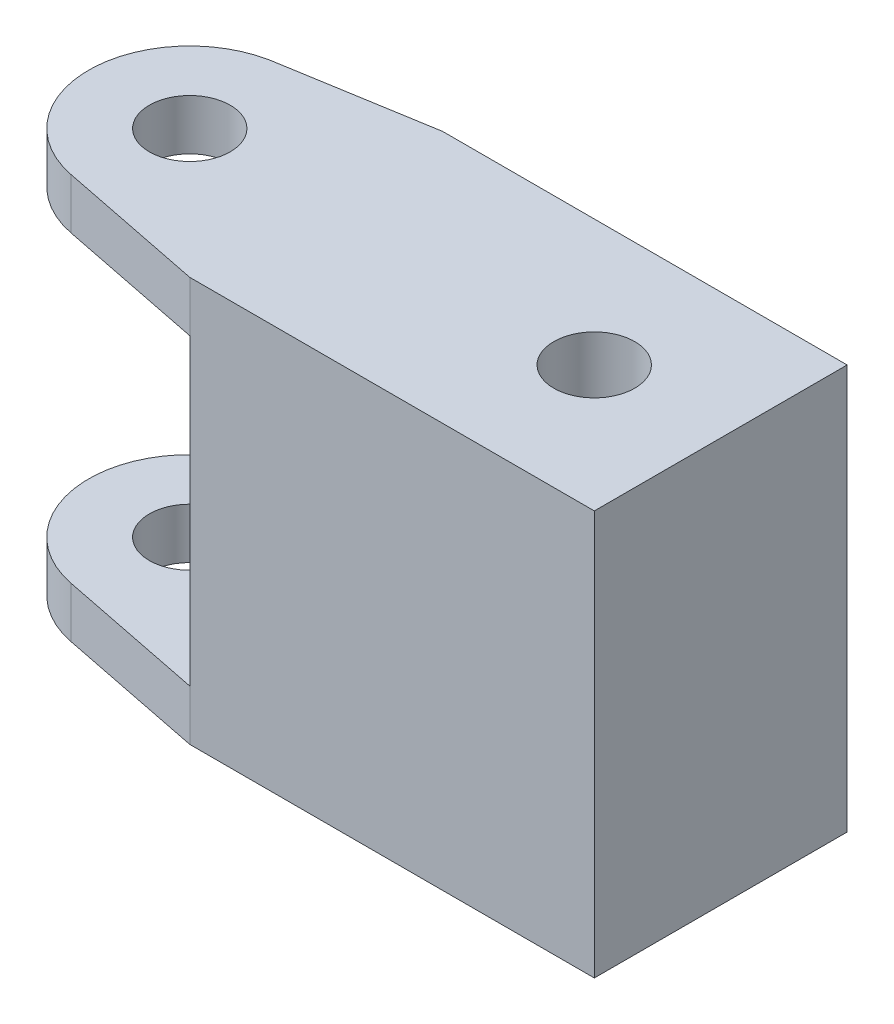
ISO-10303-21;
HEADER;
FILE_DESCRIPTION(('STEP AP214'),'2;1');
FILE_NAME('part.step','',(''),(''),'','','');
FILE_SCHEMA(('AUTOMOTIVE_DESIGN { 1 0 10303 214 1 1 1 1 }'));
ENDSEC;
DATA;
#1=APPLICATION_CONTEXT('core data for automotive mechanical design processes');
#2=APPLICATION_PROTOCOL_DEFINITION('international standard','automotive_design',2000,#1);
#3=PRODUCT_CONTEXT('',#1,'mechanical');
#4=PRODUCT('Part','Part','',(#3));
#5=PRODUCT_RELATED_PRODUCT_CATEGORY('part','',(#4));
#6=PRODUCT_DEFINITION_FORMATION('','',#4);
#7=PRODUCT_DEFINITION_CONTEXT('part definition',#1,'design');
#8=PRODUCT_DEFINITION('design','',#6,#7);
#9=PRODUCT_DEFINITION_SHAPE('','',#8);
#10=(LENGTH_UNIT() NAMED_UNIT(*) SI_UNIT(.MILLI.,.METRE.));
#11=(NAMED_UNIT(*) PLANE_ANGLE_UNIT() SI_UNIT($,.RADIAN.));
#12=(NAMED_UNIT(*) SI_UNIT($,.STERADIAN.) SOLID_ANGLE_UNIT());
#13=UNCERTAINTY_MEASURE_WITH_UNIT(LENGTH_MEASURE(1.E-05),#10,'distance_accuracy_value','');
#14=(GEOMETRIC_REPRESENTATION_CONTEXT(3) GLOBAL_UNCERTAINTY_ASSIGNED_CONTEXT((#13)) GLOBAL_UNIT_ASSIGNED_CONTEXT((#10,
#11,#12)) REPRESENTATION_CONTEXT('',''));
#15=CARTESIAN_POINT('',(0.,0.,0.));
#16=DIRECTION('',(0.,0.,1.));
#17=DIRECTION('',(1.,0.,0.));
#18=AXIS2_PLACEMENT_3D('',#15,#16,#17);
#19=CARTESIAN_POINT('',(20.,20.,25.));
#20=DIRECTION('',(-1.,0.,0.));
#21=DIRECTION('',(0.,-1.,0.));
#22=AXIS2_PLACEMENT_3D('',#19,#20,#21);
#23=PLANE('',#22);
#24=DIRECTION('',(0.,1.,0.));
#25=VECTOR('',#24,1.);
#26=CARTESIAN_POINT('',(20.,20.,0.));
#27=LINE('',#26,#25);
#28=CARTESIAN_POINT('',(20.,-20.,0.));
#29=VERTEX_POINT('',#28);
#30=CARTESIAN_POINT('',(20.,20.,0.));
#31=VERTEX_POINT('',#30);
#32=EDGE_CURVE('E202',#29,#31,#27,.T.);
#33=ORIENTED_EDGE('',*,*,#32,.T.);
#34=DIRECTION('',(0.,0.,-1.));
#35=VECTOR('',#34,1.);
#36=CARTESIAN_POINT('',(20.,20.,25.));
#37=LINE('',#36,#35);
#38=CARTESIAN_POINT('',(20.,20.,25.));
#39=VERTEX_POINT('',#38);
#40=EDGE_CURVE('E11',#39,#31,#37,.T.);
#41=ORIENTED_EDGE('',*,*,#40,.F.);
#42=DIRECTION('',(0.,1.,0.));
#43=VECTOR('',#42,1.);
#44=CARTESIAN_POINT('',(20.,20.,25.));
#45=LINE('',#44,#43);
#46=CARTESIAN_POINT('',(20.,-20.,25.));
#47=VERTEX_POINT('',#46);
#48=EDGE_CURVE('E189',#47,#39,#45,.T.);
#49=ORIENTED_EDGE('',*,*,#48,.F.);
#50=DIRECTION('',(0.,0.,-1.));
#51=VECTOR('',#50,1.);
#52=CARTESIAN_POINT('',(20.,-20.,25.));
#53=LINE('',#52,#51);
#54=EDGE_CURVE('E45',#47,#29,#53,.T.);
#55=ORIENTED_EDGE('',*,*,#54,.T.);
#56=EDGE_LOOP('',(#33,#41,#49,#55));
#57=FACE_BOUND('',#56,.T.);
#58=ADVANCED_FACE('F37',(#57),#23,.F.);
#59=CARTESIAN_POINT('',(-20.,20.,25.));
#60=DIRECTION('',(0.,-1.,0.));
#61=DIRECTION('',(0.,0.,-1.));
#62=AXIS2_PLACEMENT_3D('',#59,#60,#61);
#63=PLANE('',#62);
#64=CARTESIAN_POINT('',(7.49294183267523,20.,12.5));
#65=DIRECTION('',(0.,1.,0.));
#66=DIRECTION('',(0.,0.,1.));
#67=AXIS2_PLACEMENT_3D('',#64,#65,#66);
#68=CIRCLE('',#67,4.);
#69=CARTESIAN_POINT('',(7.49294183267523,20.,16.5));
#70=VERTEX_POINT('',#69);
#71=EDGE_CURVE('E185',#70,#70,#68,.T.);
#72=ORIENTED_EDGE('',*,*,#71,.F.);
#73=EDGE_LOOP('',(#72));
#74=FACE_BOUND('',#73,.T.);
#75=DIRECTION('',(-1.,0.,0.));
#76=VECTOR('',#75,1.);
#77=CARTESIAN_POINT('',(-20.,20.,0.));
#78=LINE('',#77,#76);
#79=CARTESIAN_POINT('',(-20.,20.,0.));
#80=VERTEX_POINT('',#79);
#81=EDGE_CURVE('E205',#31,#80,#78,.T.);
#82=ORIENTED_EDGE('',*,*,#81,.T.);
#83=DIRECTION('',(-0.986425194610526,0.,0.164211252469454));
#84=VECTOR('',#83,1.);
#85=CARTESIAN_POINT('',(-20.,20.,0.));
#86=LINE('',#85,#84);
#87=CARTESIAN_POINT('',(-34.709261200391,20.,2.44866637410884));
#88=VERTEX_POINT('',#87);
#89=EDGE_CURVE('E159',#80,#88,#86,.T.);
#90=ORIENTED_EDGE('',*,*,#89,.T.);
#91=CARTESIAN_POINT('',(-32.7499376279223,20.,12.2548405077029));
#92=DIRECTION('',(0.,1.,0.));
#93=DIRECTION('',(0.,0.,-1.));
#94=AXIS2_PLACEMENT_3D('',#91,#92,#93);
#95=CIRCLE('',#94,10.);
#96=CARTESIAN_POINT('',(-34.709261200391,20.,22.0610146412969));
#97=VERTEX_POINT('',#96);
#98=EDGE_CURVE('E178',#88,#97,#95,.T.);
#99=ORIENTED_EDGE('',*,*,#98,.T.);
#100=DIRECTION('',(0.980617413359401,0.,0.195932357246876));
#101=VECTOR('',#100,1.);
#102=CARTESIAN_POINT('',(-20.,20.,25.));
#103=LINE('',#102,#101);
#104=CARTESIAN_POINT('',(-20.,20.,25.));
#105=VERTEX_POINT('',#104);
#106=EDGE_CURVE('E166',#97,#105,#103,.T.);
#107=ORIENTED_EDGE('',*,*,#106,.T.);
#108=DIRECTION('',(-1.,0.,0.));
#109=VECTOR('',#108,1.);
#110=CARTESIAN_POINT('',(-20.,20.,25.));
#111=LINE('',#110,#109);
#112=EDGE_CURVE('E192',#39,#105,#111,.T.);
#113=ORIENTED_EDGE('',*,*,#112,.F.);
#114=ORIENTED_EDGE('',*,*,#40,.T.);
#115=EDGE_LOOP('',(#82,#90,#99,#107,#113,#114));
#116=FACE_BOUND('',#115,.T.);
#117=CARTESIAN_POINT('',(-32.7499376279223,20.,12.2548405077029));
#118=DIRECTION('',(0.,1.,0.));
#119=DIRECTION('',(0.,0.,1.));
#120=AXIS2_PLACEMENT_3D('',#117,#118,#119);
#121=CIRCLE('',#120,4.00000000000002);
#122=CARTESIAN_POINT('',(-32.7499376279223,20.,16.2548405077029));
#123=VERTEX_POINT('',#122);
#124=EDGE_CURVE('E153',#123,#123,#121,.T.);
#125=ORIENTED_EDGE('',*,*,#124,.F.);
#126=EDGE_LOOP('',(#125));
#127=FACE_BOUND('',#126,.T.);
#128=ADVANCED_FACE('F225',(#74,#116,#127),#63,.F.);
#129=CARTESIAN_POINT('',(-20.,20.,25.));
#130=DIRECTION('',(1.,0.,0.));
#131=DIRECTION('',(0.,0.,-1.));
#132=AXIS2_PLACEMENT_3D('',#129,#130,#131);
#133=PLANE('',#132);
#134=DIRECTION('',(0.,-1.,0.));
#135=VECTOR('',#134,1.);
#136=CARTESIAN_POINT('',(-20.,20.,0.));
#137=LINE('',#136,#135);
#138=CARTESIAN_POINT('',(-20.,15.,0.));
#139=VERTEX_POINT('',#138);
#140=CARTESIAN_POINT('',(-20.,-15.,0.));
#141=VERTEX_POINT('',#140);
#142=EDGE_CURVE('E208',#139,#141,#137,.T.);
#143=ORIENTED_EDGE('',*,*,#142,.T.);
#144=DIRECTION('',(0.,0.,-1.));
#145=VECTOR('',#144,1.);
#146=CARTESIAN_POINT('',(-20.,-15.,25.));
#147=LINE('',#146,#145);
#148=CARTESIAN_POINT('',(-20.,-15.,25.));
#149=VERTEX_POINT('',#148);
#150=EDGE_CURVE('E52',#149,#141,#147,.T.);
#151=ORIENTED_EDGE('',*,*,#150,.F.);
#152=DIRECTION('',(0.,-1.,0.));
#153=VECTOR('',#152,1.);
#154=CARTESIAN_POINT('',(-20.,20.,25.));
#155=LINE('',#154,#153);
#156=CARTESIAN_POINT('',(-20.,15.,25.));
#157=VERTEX_POINT('',#156);
#158=EDGE_CURVE('E196',#157,#149,#155,.T.);
#159=ORIENTED_EDGE('',*,*,#158,.F.);
#160=DIRECTION('',(0.,0.,-1.));
#161=VECTOR('',#160,1.);
#162=CARTESIAN_POINT('',(-20.,15.,25.));
#163=LINE('',#162,#161);
#164=EDGE_CURVE('E162',#157,#139,#163,.T.);
#165=ORIENTED_EDGE('',*,*,#164,.T.);
#166=EDGE_LOOP('',(#143,#151,#159,#165));
#167=FACE_BOUND('',#166,.T.);
#168=ADVANCED_FACE('F247',(#167),#133,.F.);
#169=CARTESIAN_POINT('',(-20.,-20.,25.));
#170=DIRECTION('',(0.,1.,0.));
#171=DIRECTION('',(0.,0.,1.));
#172=AXIS2_PLACEMENT_3D('',#169,#170,#171);
#173=PLANE('',#172);
#174=CARTESIAN_POINT('',(7.49294183267523,-20.,12.5));
#175=DIRECTION('',(0.,1.,0.));
#176=DIRECTION('',(0.,0.,1.));
#177=AXIS2_PLACEMENT_3D('',#174,#175,#176);
#178=CIRCLE('',#177,4.);
#179=CARTESIAN_POINT('',(7.49294183267523,-20.,16.5));
#180=VERTEX_POINT('',#179);
#181=EDGE_CURVE('E40',#180,#180,#178,.T.);
#182=ORIENTED_EDGE('',*,*,#181,.T.);
#183=EDGE_LOOP('',(#182));
#184=FACE_BOUND('',#183,.T.);
#185=DIRECTION('',(1.,0.,0.));
#186=VECTOR('',#185,1.);
#187=CARTESIAN_POINT('',(-20.,-20.,0.));
#188=LINE('',#187,#186);
#189=CARTESIAN_POINT('',(-20.,-20.,0.));
#190=VERTEX_POINT('',#189);
#191=EDGE_CURVE('E193',#190,#29,#188,.T.);
#192=ORIENTED_EDGE('',*,*,#191,.T.);
#193=ORIENTED_EDGE('',*,*,#54,.F.);
#194=DIRECTION('',(1.,0.,0.));
#195=VECTOR('',#194,1.);
#196=CARTESIAN_POINT('',(-20.,-20.,25.));
#197=LINE('',#196,#195);
#198=CARTESIAN_POINT('',(-20.,-20.,25.));
#199=VERTEX_POINT('',#198);
#200=EDGE_CURVE('E200',#199,#47,#197,.T.);
#201=ORIENTED_EDGE('',*,*,#200,.F.);
#202=DIRECTION('',(0.980617413359401,0.,0.195932357246876));
#203=VECTOR('',#202,1.);
#204=CARTESIAN_POINT('',(-20.,-20.,25.));
#205=LINE('',#204,#203);
#206=CARTESIAN_POINT('',(-34.709261200391,-20.,22.0610146412969));
#207=VERTEX_POINT('',#206);
#208=EDGE_CURVE('E147',#207,#199,#205,.T.);
#209=ORIENTED_EDGE('',*,*,#208,.F.);
#210=CARTESIAN_POINT('',(-32.7499376279223,-20.,12.2548405077029));
#211=DIRECTION('',(0.,1.,0.));
#212=DIRECTION('',(0.,0.,-1.));
#213=AXIS2_PLACEMENT_3D('',#210,#211,#212);
#214=CIRCLE('',#213,10.);
#215=CARTESIAN_POINT('',(-34.709261200391,-20.,2.44866637410884));
#216=VERTEX_POINT('',#215);
#217=EDGE_CURVE('E133',#216,#207,#214,.T.);
#218=ORIENTED_EDGE('',*,*,#217,.F.);
#219=DIRECTION('',(-0.986425194610526,0.,0.164211252469454));
#220=VECTOR('',#219,1.);
#221=CARTESIAN_POINT('',(-20.,-20.,0.));
#222=LINE('',#221,#220);
#223=EDGE_CURVE('E142',#190,#216,#222,.T.);
#224=ORIENTED_EDGE('',*,*,#223,.F.);
#225=EDGE_LOOP('',(#192,#193,#201,#209,#218,#224));
#226=FACE_BOUND('',#225,.T.);
#227=CARTESIAN_POINT('',(-32.7499376279223,-20.,12.2548405077029));
#228=DIRECTION('',(0.,1.,0.));
#229=DIRECTION('',(0.,0.,1.));
#230=AXIS2_PLACEMENT_3D('',#227,#228,#229);
#231=CIRCLE('',#230,4.00000000000002);
#232=CARTESIAN_POINT('',(-32.7499376279223,-20.,16.2548405077029));
#233=VERTEX_POINT('',#232);
#234=EDGE_CURVE('E299',#233,#233,#231,.T.);
#235=ORIENTED_EDGE('',*,*,#234,.T.);
#236=EDGE_LOOP('',(#235));
#237=FACE_BOUND('',#236,.T.);
#238=ADVANCED_FACE('F230',(#184,#226,#237),#173,.F.);
#239=CARTESIAN_POINT('',(0.,0.,25.));
#240=DIRECTION('',(0.,0.,1.));
#241=DIRECTION('',(1.,0.,0.));
#242=AXIS2_PLACEMENT_3D('',#239,#240,#241);
#243=PLANE('',#242);
#244=ORIENTED_EDGE('',*,*,#48,.T.);
#245=ORIENTED_EDGE('',*,*,#112,.T.);
#246=EDGE_CURVE('E197',#105,#157,#155,.T.);
#247=ORIENTED_EDGE('',*,*,#246,.T.);
#248=ORIENTED_EDGE('',*,*,#158,.T.);
#249=DIRECTION('',(0.,-1.,0.));
#250=VECTOR('',#249,1.);
#251=CARTESIAN_POINT('',(-20.,-15.,25.));
#252=LINE('',#251,#250);
#253=EDGE_CURVE('E138',#149,#199,#252,.T.);
#254=ORIENTED_EDGE('',*,*,#253,.T.);
#255=ORIENTED_EDGE('',*,*,#200,.T.);
#256=EDGE_LOOP('',(#244,#245,#247,#248,#254,#255));
#257=FACE_BOUND('',#256,.T.);
#258=ADVANCED_FACE('F229',(#257),#243,.T.);
#259=CARTESIAN_POINT('',(0.,0.,0.));
#260=DIRECTION('',(0.,0.,1.));
#261=DIRECTION('',(1.,0.,0.));
#262=AXIS2_PLACEMENT_3D('',#259,#260,#261);
#263=PLANE('',#262);
#264=ORIENTED_EDGE('',*,*,#32,.F.);
#265=ORIENTED_EDGE('',*,*,#191,.F.);
#266=DIRECTION('',(0.,-1.,0.));
#267=VECTOR('',#266,1.);
#268=CARTESIAN_POINT('',(-20.,-15.,0.));
#269=LINE('',#268,#267);
#270=EDGE_CURVE('E60',#141,#190,#269,.T.);
#271=ORIENTED_EDGE('',*,*,#270,.F.);
#272=ORIENTED_EDGE('',*,*,#142,.F.);
#273=EDGE_CURVE('E209',#80,#139,#137,.T.);
#274=ORIENTED_EDGE('',*,*,#273,.F.);
#275=ORIENTED_EDGE('',*,*,#81,.F.);
#276=EDGE_LOOP('',(#264,#265,#271,#272,#274,#275));
#277=FACE_BOUND('',#276,.T.);
#278=ADVANCED_FACE('F221',(#277),#263,.F.);
#279=CARTESIAN_POINT('',(7.49294183267523,-27.,12.5));
#280=DIRECTION('',(0.,1.,0.));
#281=DIRECTION('',(0.,0.,1.));
#282=AXIS2_PLACEMENT_3D('',#279,#280,#281);
#283=CYLINDRICAL_SURFACE('',#282,4.);
#284=ORIENTED_EDGE('',*,*,#71,.T.);
#285=EDGE_LOOP('',(#284));
#286=FACE_BOUND('',#285,.T.);
#287=ORIENTED_EDGE('',*,*,#181,.F.);
#288=EDGE_LOOP('',(#287));
#289=FACE_BOUND('',#288,.T.);
#290=ADVANCED_FACE('F260',(#286,#289),#283,.F.);
#291=CARTESIAN_POINT('',(-20.,15.,25.));
#292=DIRECTION('',(-0.195932357246876,0.,0.980617413359401));
#293=DIRECTION('',(0.980617413359401,0.,0.195932357246876));
#294=AXIS2_PLACEMENT_3D('',#291,#292,#293);
#295=PLANE('',#294);
#296=ORIENTED_EDGE('',*,*,#106,.F.);
#297=DIRECTION('',(0.,1.,0.));
#298=VECTOR('',#297,1.);
#299=CARTESIAN_POINT('',(-34.709261200391,15.,22.0610146412969));
#300=LINE('',#299,#298);
#301=CARTESIAN_POINT('',(-34.709261200391,15.,22.0610146412969));
#302=VERTEX_POINT('',#301);
#303=EDGE_CURVE('E183',#302,#97,#300,.T.);
#304=ORIENTED_EDGE('',*,*,#303,.F.);
#305=DIRECTION('',(0.980617413359401,0.,0.195932357246876));
#306=VECTOR('',#305,1.);
#307=CARTESIAN_POINT('',(-20.,15.,25.));
#308=LINE('',#307,#306);
#309=EDGE_CURVE('E172',#302,#157,#308,.T.);
#310=ORIENTED_EDGE('',*,*,#309,.T.);
#311=ORIENTED_EDGE('',*,*,#246,.F.);
#312=EDGE_LOOP('',(#296,#304,#310,#311));
#313=FACE_BOUND('',#312,.T.);
#314=ADVANCED_FACE('F265',(#313),#295,.T.);
#315=CARTESIAN_POINT('',(-32.7499376279223,15.,12.2548405077029));
#316=DIRECTION('',(0.,1.,0.));
#317=DIRECTION('',(0.,0.,1.));
#318=AXIS2_PLACEMENT_3D('',#315,#316,#317);
#319=CYLINDRICAL_SURFACE('',#318,10.);
#320=ORIENTED_EDGE('',*,*,#98,.F.);
#321=DIRECTION('',(0.,1.,0.));
#322=VECTOR('',#321,1.);
#323=CARTESIAN_POINT('',(-34.709261200391,15.,2.44866637410884));
#324=LINE('',#323,#322);
#325=CARTESIAN_POINT('',(-34.709261200391,15.,2.44866637410884));
#326=VERTEX_POINT('',#325);
#327=EDGE_CURVE('E175',#326,#88,#324,.T.);
#328=ORIENTED_EDGE('',*,*,#327,.F.);
#329=CARTESIAN_POINT('',(-32.7499376279223,15.,12.2548405077029));
#330=DIRECTION('',(0.,1.,0.));
#331=DIRECTION('',(0.,0.,-1.));
#332=AXIS2_PLACEMENT_3D('',#329,#330,#331);
#333=CIRCLE('',#332,10.);
#334=EDGE_CURVE('E169',#326,#302,#333,.T.);
#335=ORIENTED_EDGE('',*,*,#334,.T.);
#336=ORIENTED_EDGE('',*,*,#303,.T.);
#337=EDGE_LOOP('',(#320,#328,#335,#336));
#338=FACE_BOUND('',#337,.T.);
#339=ADVANCED_FACE('F271',(#338),#319,.T.);
#340=CARTESIAN_POINT('',(-20.,15.,0.));
#341=DIRECTION('',(-0.164211252469454,0.,-0.986425194610526));
#342=DIRECTION('',(-0.986425194610526,0.,0.164211252469454));
#343=AXIS2_PLACEMENT_3D('',#340,#341,#342);
#344=PLANE('',#343);
#345=ORIENTED_EDGE('',*,*,#89,.F.);
#346=ORIENTED_EDGE('',*,*,#273,.T.);
#347=DIRECTION('',(-0.986425194610526,0.,0.164211252469454));
#348=VECTOR('',#347,1.);
#349=CARTESIAN_POINT('',(-20.,15.,0.));
#350=LINE('',#349,#348);
#351=EDGE_CURVE('E165',#139,#326,#350,.T.);
#352=ORIENTED_EDGE('',*,*,#351,.T.);
#353=ORIENTED_EDGE('',*,*,#327,.T.);
#354=EDGE_LOOP('',(#345,#346,#352,#353));
#355=FACE_BOUND('',#354,.T.);
#356=ADVANCED_FACE('F267',(#355),#344,.T.);
#357=CARTESIAN_POINT('',(-32.7499376279223,15.,12.2548405077029));
#358=DIRECTION('',(0.,-1.,0.));
#359=DIRECTION('',(0.,0.,-1.));
#360=AXIS2_PLACEMENT_3D('',#357,#358,#359);
#361=PLANE('',#360);
#362=CARTESIAN_POINT('',(-32.7499376279223,15.,12.2548405077029));
#363=DIRECTION('',(0.,1.,0.));
#364=DIRECTION('',(0.,0.,1.));
#365=AXIS2_PLACEMENT_3D('',#362,#363,#364);
#366=CIRCLE('',#365,4.00000000000002);
#367=CARTESIAN_POINT('',(-32.7499376279223,15.,16.2548405077029));
#368=VERTEX_POINT('',#367);
#369=EDGE_CURVE('E156',#368,#368,#366,.T.);
#370=ORIENTED_EDGE('',*,*,#369,.T.);
#371=EDGE_LOOP('',(#370));
#372=FACE_BOUND('',#371,.T.);
#373=ORIENTED_EDGE('',*,*,#164,.F.);
#374=ORIENTED_EDGE('',*,*,#309,.F.);
#375=ORIENTED_EDGE('',*,*,#334,.F.);
#376=ORIENTED_EDGE('',*,*,#351,.F.);
#377=EDGE_LOOP('',(#373,#374,#375,#376));
#378=FACE_BOUND('',#377,.T.);
#379=ADVANCED_FACE('F270',(#372,#378),#361,.T.);
#380=CARTESIAN_POINT('',(-32.7499376279223,15.,12.2548405077029));
#381=DIRECTION('',(0.,1.,0.));
#382=DIRECTION('',(0.,0.,1.));
#383=AXIS2_PLACEMENT_3D('',#380,#381,#382);
#384=CYLINDRICAL_SURFACE('',#383,4.00000000000002);
#385=ORIENTED_EDGE('',*,*,#369,.F.);
#386=EDGE_LOOP('',(#385));
#387=FACE_BOUND('',#386,.T.);
#388=ORIENTED_EDGE('',*,*,#124,.T.);
#389=EDGE_LOOP('',(#388));
#390=FACE_BOUND('',#389,.T.);
#391=ADVANCED_FACE('F241',(#387,#390),#384,.F.);
#392=CARTESIAN_POINT('',(-32.7499376279223,-15.,12.2548405077029));
#393=DIRECTION('',(0.,1.,0.));
#394=DIRECTION('',(0.,0.,-1.));
#395=AXIS2_PLACEMENT_3D('',#392,#393,#394);
#396=PLANE('',#395);
#397=ORIENTED_EDGE('',*,*,#150,.T.);
#398=DIRECTION('',(-0.986425194610526,0.,0.164211252469454));
#399=VECTOR('',#398,1.);
#400=CARTESIAN_POINT('',(-20.,-15.,0.));
#401=LINE('',#400,#399);
#402=CARTESIAN_POINT('',(-34.709261200391,-15.,2.44866637410884));
#403=VERTEX_POINT('',#402);
#404=EDGE_CURVE('E124',#141,#403,#401,.T.);
#405=ORIENTED_EDGE('',*,*,#404,.T.);
#406=CARTESIAN_POINT('',(-32.7499376279223,-15.,12.2548405077029));
#407=DIRECTION('',(0.,1.,0.));
#408=DIRECTION('',(0.,0.,-1.));
#409=AXIS2_PLACEMENT_3D('',#406,#407,#408);
#410=CIRCLE('',#409,10.);
#411=CARTESIAN_POINT('',(-34.709261200391,-15.,22.0610146412969));
#412=VERTEX_POINT('',#411);
#413=EDGE_CURVE('E116',#403,#412,#410,.T.);
#414=ORIENTED_EDGE('',*,*,#413,.T.);
#415=DIRECTION('',(0.980617413359401,0.,0.195932357246876));
#416=VECTOR('',#415,1.);
#417=CARTESIAN_POINT('',(-20.,-15.,25.));
#418=LINE('',#417,#416);
#419=EDGE_CURVE('E121',#412,#149,#418,.T.);
#420=ORIENTED_EDGE('',*,*,#419,.T.);
#421=EDGE_LOOP('',(#397,#405,#414,#420));
#422=FACE_BOUND('',#421,.T.);
#423=CARTESIAN_POINT('',(-32.7499376279223,-15.,12.2548405077029));
#424=DIRECTION('',(0.,1.,0.));
#425=DIRECTION('',(0.,0.,1.));
#426=AXIS2_PLACEMENT_3D('',#423,#424,#425);
#427=CIRCLE('',#426,4.00000000000002);
#428=CARTESIAN_POINT('',(-32.7499376279223,-15.,16.2548405077029));
#429=VERTEX_POINT('',#428);
#430=EDGE_CURVE('E149',#429,#429,#427,.T.);
#431=ORIENTED_EDGE('',*,*,#430,.F.);
#432=EDGE_LOOP('',(#431));
#433=FACE_BOUND('',#432,.T.);
#434=ADVANCED_FACE('F118',(#422,#433),#396,.T.);
#435=CARTESIAN_POINT('',(-20.,-15.,0.));
#436=DIRECTION('',(0.164211252469454,0.,0.986425194610526));
#437=DIRECTION('',(0.986425194610526,0.,-0.164211252469454));
#438=AXIS2_PLACEMENT_3D('',#435,#436,#437);
#439=PLANE('',#438);
#440=ORIENTED_EDGE('',*,*,#223,.T.);
#441=DIRECTION('',(0.,-1.,0.));
#442=VECTOR('',#441,1.);
#443=CARTESIAN_POINT('',(-34.709261200391,-15.,2.44866637410884));
#444=LINE('',#443,#442);
#445=EDGE_CURVE('E137',#403,#216,#444,.T.);
#446=ORIENTED_EDGE('',*,*,#445,.F.);
#447=ORIENTED_EDGE('',*,*,#404,.F.);
#448=ORIENTED_EDGE('',*,*,#270,.T.);
#449=EDGE_LOOP('',(#440,#446,#447,#448));
#450=FACE_BOUND('',#449,.T.);
#451=ADVANCED_FACE('F233',(#450),#439,.F.);
#452=CARTESIAN_POINT('',(-32.7499376279223,-15.,12.2548405077029));
#453=DIRECTION('',(0.,-1.,0.));
#454=DIRECTION('',(0.,0.,-1.));
#455=AXIS2_PLACEMENT_3D('',#452,#453,#454);
#456=CYLINDRICAL_SURFACE('',#455,10.);
#457=ORIENTED_EDGE('',*,*,#217,.T.);
#458=DIRECTION('',(0.,-1.,0.));
#459=VECTOR('',#458,1.);
#460=CARTESIAN_POINT('',(-34.709261200391,-15.,22.0610146412969));
#461=LINE('',#460,#459);
#462=EDGE_CURVE('E130',#412,#207,#461,.T.);
#463=ORIENTED_EDGE('',*,*,#462,.F.);
#464=ORIENTED_EDGE('',*,*,#413,.F.);
#465=ORIENTED_EDGE('',*,*,#445,.T.);
#466=EDGE_LOOP('',(#457,#463,#464,#465));
#467=FACE_BOUND('',#466,.T.);
#468=ADVANCED_FACE('F131',(#467),#456,.T.);
#469=CARTESIAN_POINT('',(-20.,-15.,25.));
#470=DIRECTION('',(0.195932357246876,0.,-0.980617413359401));
#471=DIRECTION('',(-0.980617413359401,0.,-0.195932357246876));
#472=AXIS2_PLACEMENT_3D('',#469,#470,#471);
#473=PLANE('',#472);
#474=ORIENTED_EDGE('',*,*,#208,.T.);
#475=ORIENTED_EDGE('',*,*,#253,.F.);
#476=ORIENTED_EDGE('',*,*,#419,.F.);
#477=ORIENTED_EDGE('',*,*,#462,.T.);
#478=EDGE_LOOP('',(#474,#475,#476,#477));
#479=FACE_BOUND('',#478,.T.);
#480=ADVANCED_FACE('F140',(#479),#473,.F.);
#481=CARTESIAN_POINT('',(-32.7499376279223,-15.,12.2548405077029));
#482=DIRECTION('',(0.,-1.,0.));
#483=DIRECTION('',(0.,0.,-1.));
#484=AXIS2_PLACEMENT_3D('',#481,#482,#483);
#485=CYLINDRICAL_SURFACE('',#484,4.00000000000002);
#486=ORIENTED_EDGE('',*,*,#430,.T.);
#487=EDGE_LOOP('',(#486));
#488=FACE_BOUND('',#487,.T.);
#489=ORIENTED_EDGE('',*,*,#234,.F.);
#490=EDGE_LOOP('',(#489));
#491=FACE_BOUND('',#490,.T.);
#492=ADVANCED_FACE('F286',(#488,#491),#485,.F.);
#493=CLOSED_SHELL('',(#58,#128,#168,#238,#258,#278,#290,#314,#339,#356,#379,#391,#434,#451,#468,
#480,#492));
#494=MANIFOLD_SOLID_BREP('B2',#493);
#495=ADVANCED_BREP_SHAPE_REPRESENTATION('',(#18,#494),#14);
#496=SHAPE_DEFINITION_REPRESENTATION(#9,#495);
ENDSEC;
END-ISO-10303-21;
